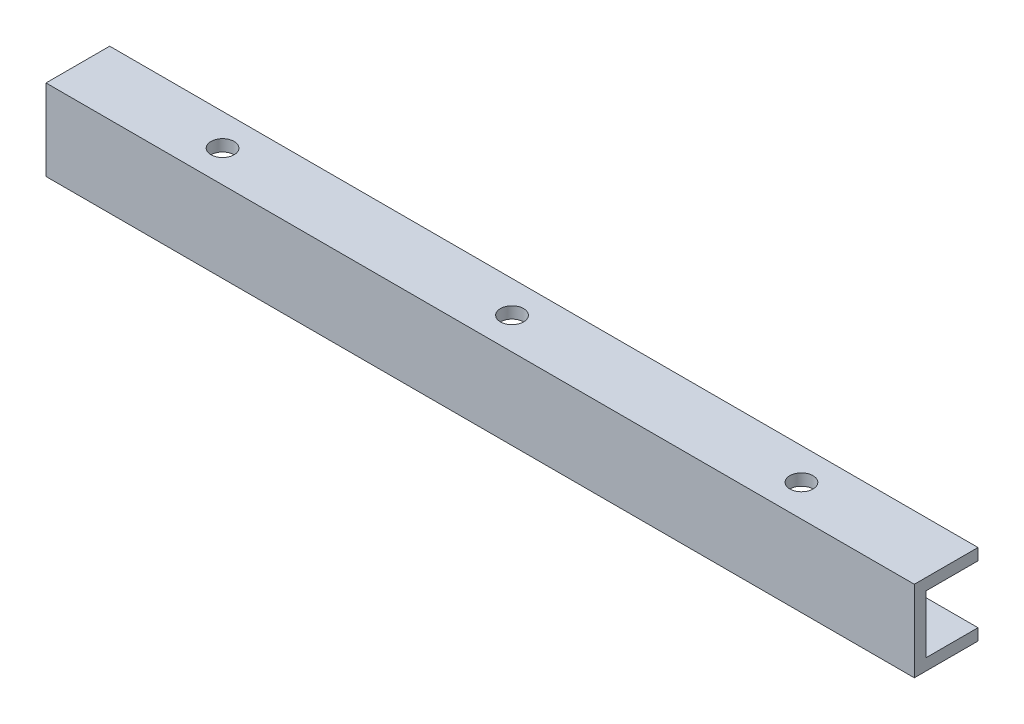
ISO-10303-21;
HEADER;
FILE_DESCRIPTION(('STEP AP214'),'2;1');
FILE_NAME('part.step','',(''),(''),'','','');
FILE_SCHEMA(('AUTOMOTIVE_DESIGN { 1 0 10303 214 1 1 1 1 }'));
ENDSEC;
DATA;
#1=APPLICATION_CONTEXT('core data for automotive mechanical design processes');
#2=APPLICATION_PROTOCOL_DEFINITION('international standard','automotive_design',2000,#1);
#3=PRODUCT_CONTEXT('',#1,'mechanical');
#4=PRODUCT('Part','Part','',(#3));
#5=PRODUCT_RELATED_PRODUCT_CATEGORY('part','',(#4));
#6=PRODUCT_DEFINITION_FORMATION('','',#4);
#7=PRODUCT_DEFINITION_CONTEXT('part definition',#1,'design');
#8=PRODUCT_DEFINITION('design','',#6,#7);
#9=PRODUCT_DEFINITION_SHAPE('','',#8);
#10=(LENGTH_UNIT() NAMED_UNIT(*) SI_UNIT(.MILLI.,.METRE.));
#11=(NAMED_UNIT(*) PLANE_ANGLE_UNIT() SI_UNIT($,.RADIAN.));
#12=(NAMED_UNIT(*) SI_UNIT($,.STERADIAN.) SOLID_ANGLE_UNIT());
#13=UNCERTAINTY_MEASURE_WITH_UNIT(LENGTH_MEASURE(1.E-05),#10,'distance_accuracy_value','');
#14=(GEOMETRIC_REPRESENTATION_CONTEXT(3) GLOBAL_UNCERTAINTY_ASSIGNED_CONTEXT((#13)) GLOBAL_UNIT_ASSIGNED_CONTEXT((#10,
#11,#12)) REPRESENTATION_CONTEXT('',''));
#15=CARTESIAN_POINT('',(0.,0.,0.));
#16=DIRECTION('',(0.,0.,1.));
#17=DIRECTION('',(1.,0.,0.));
#18=AXIS2_PLACEMENT_3D('',#15,#16,#17);
#19=CARTESIAN_POINT('',(0.,-12.,10.));
#20=DIRECTION('',(1.,0.,0.));
#21=DIRECTION('',(0.,0.,-1.));
#22=AXIS2_PLACEMENT_3D('',#19,#20,#21);
#23=PLANE('',#22);
#24=DIRECTION('',(0.,0.,1.));
#25=VECTOR('',#24,1.);
#26=CARTESIAN_POINT('',(0.,-11.,10.));
#27=LINE('',#26,#25);
#28=CARTESIAN_POINT('',(0.,-11.,9.));
#29=VERTEX_POINT('',#28);
#30=CARTESIAN_POINT('',(0.,-11.,0.));
#31=VERTEX_POINT('',#30);
#32=EDGE_CURVE('E162',#29,#31,#27,.F.);
#33=ORIENTED_EDGE('',*,*,#32,.F.);
#34=DIRECTION('',(0.,1.,0.));
#35=VECTOR('',#34,1.);
#36=CARTESIAN_POINT('',(0.,0.,9.));
#37=LINE('',#36,#35);
#38=CARTESIAN_POINT('',(0.,-1.,9.));
#39=VERTEX_POINT('',#38);
#40=EDGE_CURVE('E136',#39,#29,#37,.F.);
#41=ORIENTED_EDGE('',*,*,#40,.F.);
#42=DIRECTION('',(0.,0.,-1.));
#43=VECTOR('',#42,1.);
#44=CARTESIAN_POINT('',(0.,-1.,0.));
#45=LINE('',#44,#43);
#46=CARTESIAN_POINT('',(0.,-1.,0.));
#47=VERTEX_POINT('',#46);
#48=EDGE_CURVE('E94',#47,#39,#45,.F.);
#49=ORIENTED_EDGE('',*,*,#48,.F.);
#50=DIRECTION('',(0.,-1.,0.));
#51=VECTOR('',#50,1.);
#52=CARTESIAN_POINT('',(0.,0.,0.));
#53=LINE('',#52,#51);
#54=CARTESIAN_POINT('',(0.,1.,0.));
#55=VERTEX_POINT('',#54);
#56=EDGE_CURVE('E11',#55,#47,#53,.T.);
#57=ORIENTED_EDGE('',*,*,#56,.F.);
#58=DIRECTION('',(0.,0.,-1.));
#59=VECTOR('',#58,1.);
#60=CARTESIAN_POINT('',(0.,1.,0.));
#61=LINE('',#60,#59);
#62=CARTESIAN_POINT('',(0.,0.999999999999999,11.));
#63=VERTEX_POINT('',#62);
#64=EDGE_CURVE('E92',#55,#63,#61,.F.);
#65=ORIENTED_EDGE('',*,*,#64,.T.);
#66=DIRECTION('',(0.,1.,0.));
#67=VECTOR('',#66,1.);
#68=CARTESIAN_POINT('',(0.,0.,11.));
#69=LINE('',#68,#67);
#70=CARTESIAN_POINT('',(0.,-13.,11.));
#71=VERTEX_POINT('',#70);
#72=EDGE_CURVE('E115',#63,#71,#69,.F.);
#73=ORIENTED_EDGE('',*,*,#72,.T.);
#74=DIRECTION('',(0.,0.,1.));
#75=VECTOR('',#74,1.);
#76=CARTESIAN_POINT('',(0.,-13.,10.));
#77=LINE('',#76,#75);
#78=CARTESIAN_POINT('',(0.,-13.,0.));
#79=VERTEX_POINT('',#78);
#80=EDGE_CURVE('E143',#71,#79,#77,.F.);
#81=ORIENTED_EDGE('',*,*,#80,.T.);
#82=DIRECTION('',(0.,1.,0.));
#83=VECTOR('',#82,1.);
#84=CARTESIAN_POINT('',(0.,-12.,0.));
#85=LINE('',#84,#83);
#86=EDGE_CURVE('E45',#79,#31,#85,.T.);
#87=ORIENTED_EDGE('',*,*,#86,.T.);
#88=EDGE_LOOP('',(#33,#41,#49,#57,#65,#73,#81,#87));
#89=FACE_BOUND('',#88,.T.);
#90=ADVANCED_FACE('F35',(#89),#23,.T.);
#91=CARTESIAN_POINT('',(0.,-12.,0.));
#92=DIRECTION('',(0.,0.,-1.));
#93=DIRECTION('',(-1.,0.,0.));
#94=AXIS2_PLACEMENT_3D('',#91,#92,#93);
#95=PLANE('',#94);
#96=ORIENTED_EDGE('',*,*,#86,.F.);
#97=DIRECTION('',(1.,0.,0.));
#98=VECTOR('',#97,1.);
#99=CARTESIAN_POINT('',(0.,-13.,0.));
#100=LINE('',#99,#98);
#101=CARTESIAN_POINT('',(-150.,-13.,0.));
#102=VERTEX_POINT('',#101);
#103=EDGE_CURVE('E148',#79,#102,#100,.F.);
#104=ORIENTED_EDGE('',*,*,#103,.T.);
#105=DIRECTION('',(0.,1.,0.));
#106=VECTOR('',#105,1.);
#107=CARTESIAN_POINT('',(-150.,-12.,0.));
#108=LINE('',#107,#106);
#109=CARTESIAN_POINT('',(-150.,-11.,0.));
#110=VERTEX_POINT('',#109);
#111=EDGE_CURVE('E118',#102,#110,#108,.T.);
#112=ORIENTED_EDGE('',*,*,#111,.T.);
#113=DIRECTION('',(1.,0.,0.));
#114=VECTOR('',#113,1.);
#115=CARTESIAN_POINT('',(0.,-11.,0.));
#116=LINE('',#115,#114);
#117=EDGE_CURVE('E158',#31,#110,#116,.F.);
#118=ORIENTED_EDGE('',*,*,#117,.F.);
#119=EDGE_LOOP('',(#96,#104,#112,#118));
#120=FACE_BOUND('',#119,.T.);
#121=ADVANCED_FACE('F157',(#120),#95,.T.);
#122=CARTESIAN_POINT('',(-150.,0.,0.));
#123=DIRECTION('',(1.,0.,0.));
#124=DIRECTION('',(0.,0.,1.));
#125=AXIS2_PLACEMENT_3D('',#122,#123,#124);
#126=PLANE('',#125);
#127=DIRECTION('',(0.,0.,-1.));
#128=VECTOR('',#127,1.);
#129=CARTESIAN_POINT('',(-150.,-1.,0.));
#130=LINE('',#129,#128);
#131=CARTESIAN_POINT('',(-150.,-1.,0.));
#132=VERTEX_POINT('',#131);
#133=CARTESIAN_POINT('',(-150.,-1.,9.));
#134=VERTEX_POINT('',#133);
#135=EDGE_CURVE('E133',#132,#134,#130,.F.);
#136=ORIENTED_EDGE('',*,*,#135,.T.);
#137=DIRECTION('',(0.,1.,0.));
#138=VECTOR('',#137,1.);
#139=CARTESIAN_POINT('',(-150.,0.,9.));
#140=LINE('',#139,#138);
#141=CARTESIAN_POINT('',(-150.,-11.,9.));
#142=VERTEX_POINT('',#141);
#143=EDGE_CURVE('E161',#134,#142,#140,.F.);
#144=ORIENTED_EDGE('',*,*,#143,.T.);
#145=DIRECTION('',(0.,0.,1.));
#146=VECTOR('',#145,1.);
#147=CARTESIAN_POINT('',(-150.,-11.,10.));
#148=LINE('',#147,#146);
#149=EDGE_CURVE('E109',#142,#110,#148,.F.);
#150=ORIENTED_EDGE('',*,*,#149,.T.);
#151=ORIENTED_EDGE('',*,*,#111,.F.);
#152=DIRECTION('',(0.,0.,1.));
#153=VECTOR('',#152,1.);
#154=CARTESIAN_POINT('',(-150.,-13.,10.));
#155=LINE('',#154,#153);
#156=CARTESIAN_POINT('',(-150.,-13.,11.));
#157=VERTEX_POINT('',#156);
#158=EDGE_CURVE('E144',#157,#102,#155,.F.);
#159=ORIENTED_EDGE('',*,*,#158,.F.);
#160=DIRECTION('',(0.,1.,0.));
#161=VECTOR('',#160,1.);
#162=CARTESIAN_POINT('',(-150.,0.,11.));
#163=LINE('',#162,#161);
#164=CARTESIAN_POINT('',(-150.,0.999999999999999,11.));
#165=VERTEX_POINT('',#164);
#166=EDGE_CURVE('E140',#165,#157,#163,.F.);
#167=ORIENTED_EDGE('',*,*,#166,.F.);
#168=DIRECTION('',(0.,0.,-1.));
#169=VECTOR('',#168,1.);
#170=CARTESIAN_POINT('',(-150.,1.,0.));
#171=LINE('',#170,#169);
#172=CARTESIAN_POINT('',(-150.,1.,0.));
#173=VERTEX_POINT('',#172);
#174=EDGE_CURVE('E104',#173,#165,#171,.F.);
#175=ORIENTED_EDGE('',*,*,#174,.F.);
#176=DIRECTION('',(0.,-1.,0.));
#177=VECTOR('',#176,1.);
#178=CARTESIAN_POINT('',(-150.,0.,0.));
#179=LINE('',#178,#177);
#180=EDGE_CURVE('E39',#173,#132,#179,.T.);
#181=ORIENTED_EDGE('',*,*,#180,.T.);
#182=EDGE_LOOP('',(#136,#144,#150,#151,#159,#167,#175,#181));
#183=FACE_BOUND('',#182,.T.);
#184=ADVANCED_FACE('F238',(#183),#126,.F.);
#185=CARTESIAN_POINT('',(0.,0.,0.));
#186=DIRECTION('',(0.,0.,1.));
#187=DIRECTION('',(-1.,0.,0.));
#188=AXIS2_PLACEMENT_3D('',#185,#186,#187);
#189=PLANE('',#188);
#190=DIRECTION('',(1.,0.,0.));
#191=VECTOR('',#190,1.);
#192=CARTESIAN_POINT('',(0.,1.,0.));
#193=LINE('',#192,#191);
#194=EDGE_CURVE('E100',#55,#173,#193,.F.);
#195=ORIENTED_EDGE('',*,*,#194,.F.);
#196=ORIENTED_EDGE('',*,*,#56,.T.);
#197=DIRECTION('',(1.,0.,0.));
#198=VECTOR('',#197,1.);
#199=CARTESIAN_POINT('',(0.,-1.,0.));
#200=LINE('',#199,#198);
#201=EDGE_CURVE('E128',#47,#132,#200,.F.);
#202=ORIENTED_EDGE('',*,*,#201,.T.);
#203=ORIENTED_EDGE('',*,*,#180,.F.);
#204=EDGE_LOOP('',(#195,#196,#202,#203));
#205=FACE_BOUND('',#204,.T.);
#206=ADVANCED_FACE('F37',(#205),#189,.F.);
#207=CARTESIAN_POINT('',(0.,-1.,0.));
#208=DIRECTION('',(0.,-1.,0.));
#209=DIRECTION('',(0.,0.,-1.));
#210=AXIS2_PLACEMENT_3D('',#207,#208,#209);
#211=PLANE('',#210);
#212=CARTESIAN_POINT('',(-125.,-1.,5.5));
#213=DIRECTION('',(0.,-1.,0.));
#214=DIRECTION('',(0.,0.,-1.));
#215=AXIS2_PLACEMENT_3D('',#212,#213,#214);
#216=CIRCLE('',#215,2.);
#217=CARTESIAN_POINT('',(-125.,-1.,3.5));
#218=VERTEX_POINT('',#217);
#219=EDGE_CURVE('E198',#218,#218,#216,.T.);
#220=ORIENTED_EDGE('',*,*,#219,.F.);
#221=EDGE_LOOP('',(#220));
#222=FACE_BOUND('',#221,.T.);
#223=CARTESIAN_POINT('',(-75.,-1.,5.5));
#224=DIRECTION('',(0.,-1.,0.));
#225=DIRECTION('',(0.,0.,-1.));
#226=AXIS2_PLACEMENT_3D('',#223,#224,#225);
#227=CIRCLE('',#226,2.);
#228=CARTESIAN_POINT('',(-75.,-1.,3.5));
#229=VERTEX_POINT('',#228);
#230=EDGE_CURVE('E183',#229,#229,#227,.T.);
#231=ORIENTED_EDGE('',*,*,#230,.F.);
#232=EDGE_LOOP('',(#231));
#233=FACE_BOUND('',#232,.T.);
#234=CARTESIAN_POINT('',(-25.,-1.,5.5));
#235=DIRECTION('',(0.,-1.,0.));
#236=DIRECTION('',(0.,0.,-1.));
#237=AXIS2_PLACEMENT_3D('',#234,#235,#236);
#238=CIRCLE('',#237,2.);
#239=CARTESIAN_POINT('',(-25.,-1.,3.5));
#240=VERTEX_POINT('',#239);
#241=EDGE_CURVE('E151',#240,#240,#238,.T.);
#242=ORIENTED_EDGE('',*,*,#241,.F.);
#243=EDGE_LOOP('',(#242));
#244=FACE_BOUND('',#243,.T.);
#245=ORIENTED_EDGE('',*,*,#135,.F.);
#246=ORIENTED_EDGE('',*,*,#201,.F.);
#247=ORIENTED_EDGE('',*,*,#48,.T.);
#248=DIRECTION('',(-1.,0.,0.));
#249=VECTOR('',#248,1.);
#250=CARTESIAN_POINT('',(0.,-1.,9.));
#251=LINE('',#250,#249);
#252=EDGE_CURVE('E165',#39,#134,#251,.T.);
#253=ORIENTED_EDGE('',*,*,#252,.T.);
#254=EDGE_LOOP('',(#245,#246,#247,#253));
#255=FACE_BOUND('',#254,.T.);
#256=ADVANCED_FACE('F254',(#222,#233,#244,#255),#211,.T.);
#257=CARTESIAN_POINT('',(0.,0.,9.));
#258=DIRECTION('',(0.,0.,-1.));
#259=DIRECTION('',(0.,1.,0.));
#260=AXIS2_PLACEMENT_3D('',#257,#258,#259);
#261=PLANE('',#260);
#262=ORIENTED_EDGE('',*,*,#143,.F.);
#263=ORIENTED_EDGE('',*,*,#252,.F.);
#264=ORIENTED_EDGE('',*,*,#40,.T.);
#265=DIRECTION('',(-1.,0.,0.));
#266=VECTOR('',#265,1.);
#267=CARTESIAN_POINT('',(0.,-11.,9.));
#268=LINE('',#267,#266);
#269=EDGE_CURVE('E112',#29,#142,#268,.T.);
#270=ORIENTED_EDGE('',*,*,#269,.T.);
#271=EDGE_LOOP('',(#262,#263,#264,#270));
#272=FACE_BOUND('',#271,.T.);
#273=ADVANCED_FACE('F251',(#272),#261,.T.);
#274=CARTESIAN_POINT('',(0.,-11.,10.));
#275=DIRECTION('',(0.,1.,0.));
#276=DIRECTION('',(0.,0.,1.));
#277=AXIS2_PLACEMENT_3D('',#274,#275,#276);
#278=PLANE('',#277);
#279=CARTESIAN_POINT('',(-125.,-11.,5.5));
#280=DIRECTION('',(0.,1.,0.));
#281=DIRECTION('',(0.,0.,1.));
#282=AXIS2_PLACEMENT_3D('',#279,#280,#281);
#283=CIRCLE('',#282,2.);
#284=CARTESIAN_POINT('',(-125.,-11.,7.5));
#285=VERTEX_POINT('',#284);
#286=EDGE_CURVE('E195',#285,#285,#283,.T.);
#287=ORIENTED_EDGE('',*,*,#286,.F.);
#288=EDGE_LOOP('',(#287));
#289=FACE_BOUND('',#288,.T.);
#290=CARTESIAN_POINT('',(-75.,-11.,5.5));
#291=DIRECTION('',(0.,1.,0.));
#292=DIRECTION('',(0.,0.,1.));
#293=AXIS2_PLACEMENT_3D('',#290,#291,#292);
#294=CIRCLE('',#293,2.);
#295=CARTESIAN_POINT('',(-75.,-11.,7.5));
#296=VERTEX_POINT('',#295);
#297=EDGE_CURVE('E186',#296,#296,#294,.T.);
#298=ORIENTED_EDGE('',*,*,#297,.F.);
#299=EDGE_LOOP('',(#298));
#300=FACE_BOUND('',#299,.T.);
#301=CARTESIAN_POINT('',(-25.,-11.,5.5));
#302=DIRECTION('',(0.,1.,0.));
#303=DIRECTION('',(0.,0.,1.));
#304=AXIS2_PLACEMENT_3D('',#301,#302,#303);
#305=CIRCLE('',#304,2.);
#306=CARTESIAN_POINT('',(-25.,-11.,7.5));
#307=VERTEX_POINT('',#306);
#308=EDGE_CURVE('E174',#307,#307,#305,.T.);
#309=ORIENTED_EDGE('',*,*,#308,.F.);
#310=EDGE_LOOP('',(#309));
#311=FACE_BOUND('',#310,.T.);
#312=ORIENTED_EDGE('',*,*,#149,.F.);
#313=ORIENTED_EDGE('',*,*,#269,.F.);
#314=ORIENTED_EDGE('',*,*,#32,.T.);
#315=ORIENTED_EDGE('',*,*,#117,.T.);
#316=EDGE_LOOP('',(#312,#313,#314,#315));
#317=FACE_BOUND('',#316,.T.);
#318=ADVANCED_FACE('F213',(#289,#300,#311,#317),#278,.T.);
#319=CARTESIAN_POINT('',(0.,1.,0.));
#320=DIRECTION('',(0.,-1.,0.));
#321=DIRECTION('',(0.,0.,-1.));
#322=AXIS2_PLACEMENT_3D('',#319,#320,#321);
#323=PLANE('',#322);
#324=CARTESIAN_POINT('',(-125.,0.999999999999999,5.5));
#325=DIRECTION('',(0.,1.,0.));
#326=DIRECTION('',(0.,0.,1.));
#327=AXIS2_PLACEMENT_3D('',#324,#325,#326);
#328=CIRCLE('',#327,2.);
#329=CARTESIAN_POINT('',(-125.,0.999999999999999,7.5));
#330=VERTEX_POINT('',#329);
#331=EDGE_CURVE('E204',#330,#330,#328,.T.);
#332=ORIENTED_EDGE('',*,*,#331,.F.);
#333=EDGE_LOOP('',(#332));
#334=FACE_BOUND('',#333,.T.);
#335=CARTESIAN_POINT('',(-75.,0.999999999999999,5.5));
#336=DIRECTION('',(0.,1.,0.));
#337=DIRECTION('',(0.,0.,1.));
#338=AXIS2_PLACEMENT_3D('',#335,#336,#337);
#339=CIRCLE('',#338,2.);
#340=CARTESIAN_POINT('',(-75.,0.999999999999999,7.5));
#341=VERTEX_POINT('',#340);
#342=EDGE_CURVE('E192',#341,#341,#339,.T.);
#343=ORIENTED_EDGE('',*,*,#342,.F.);
#344=EDGE_LOOP('',(#343));
#345=FACE_BOUND('',#344,.T.);
#346=CARTESIAN_POINT('',(-25.,0.999999999999999,5.5));
#347=DIRECTION('',(0.,1.,0.));
#348=DIRECTION('',(0.,0.,1.));
#349=AXIS2_PLACEMENT_3D('',#346,#347,#348);
#350=CIRCLE('',#349,2.);
#351=CARTESIAN_POINT('',(-25.,0.999999999999999,7.5));
#352=VERTEX_POINT('',#351);
#353=EDGE_CURVE('E180',#352,#352,#350,.T.);
#354=ORIENTED_EDGE('',*,*,#353,.F.);
#355=EDGE_LOOP('',(#354));
#356=FACE_BOUND('',#355,.T.);
#357=ORIENTED_EDGE('',*,*,#174,.T.);
#358=DIRECTION('',(-1.,0.,0.));
#359=VECTOR('',#358,1.);
#360=CARTESIAN_POINT('',(0.,0.999999999999999,11.));
#361=LINE('',#360,#359);
#362=EDGE_CURVE('E107',#63,#165,#361,.T.);
#363=ORIENTED_EDGE('',*,*,#362,.F.);
#364=ORIENTED_EDGE('',*,*,#64,.F.);
#365=ORIENTED_EDGE('',*,*,#194,.T.);
#366=EDGE_LOOP('',(#357,#363,#364,#365));
#367=FACE_BOUND('',#366,.T.);
#368=ADVANCED_FACE('F106',(#334,#345,#356,#367),#323,.F.);
#369=CARTESIAN_POINT('',(0.,0.,11.));
#370=DIRECTION('',(0.,0.,-1.));
#371=DIRECTION('',(0.,1.,0.));
#372=AXIS2_PLACEMENT_3D('',#369,#370,#371);
#373=PLANE('',#372);
#374=ORIENTED_EDGE('',*,*,#166,.T.);
#375=DIRECTION('',(-1.,0.,0.));
#376=VECTOR('',#375,1.);
#377=CARTESIAN_POINT('',(0.,-13.,11.));
#378=LINE('',#377,#376);
#379=EDGE_CURVE('E141',#71,#157,#378,.T.);
#380=ORIENTED_EDGE('',*,*,#379,.F.);
#381=ORIENTED_EDGE('',*,*,#72,.F.);
#382=ORIENTED_EDGE('',*,*,#362,.T.);
#383=EDGE_LOOP('',(#374,#380,#381,#382));
#384=FACE_BOUND('',#383,.T.);
#385=ADVANCED_FACE('F212',(#384),#373,.F.);
#386=CARTESIAN_POINT('',(0.,-13.,10.));
#387=DIRECTION('',(0.,1.,0.));
#388=DIRECTION('',(0.,0.,1.));
#389=AXIS2_PLACEMENT_3D('',#386,#387,#388);
#390=PLANE('',#389);
#391=CARTESIAN_POINT('',(-125.,-13.,5.5));
#392=DIRECTION('',(0.,1.,0.));
#393=DIRECTION('',(0.,0.,1.));
#394=AXIS2_PLACEMENT_3D('',#391,#392,#393);
#395=CIRCLE('',#394,2.);
#396=CARTESIAN_POINT('',(-125.,-13.,7.5));
#397=VERTEX_POINT('',#396);
#398=EDGE_CURVE('E201',#397,#397,#395,.T.);
#399=ORIENTED_EDGE('',*,*,#398,.T.);
#400=EDGE_LOOP('',(#399));
#401=FACE_BOUND('',#400,.T.);
#402=CARTESIAN_POINT('',(-75.,-13.,5.5));
#403=DIRECTION('',(0.,1.,0.));
#404=DIRECTION('',(0.,0.,1.));
#405=AXIS2_PLACEMENT_3D('',#402,#403,#404);
#406=CIRCLE('',#405,2.);
#407=CARTESIAN_POINT('',(-75.,-13.,7.5));
#408=VERTEX_POINT('',#407);
#409=EDGE_CURVE('E189',#408,#408,#406,.T.);
#410=ORIENTED_EDGE('',*,*,#409,.T.);
#411=EDGE_LOOP('',(#410));
#412=FACE_BOUND('',#411,.T.);
#413=CARTESIAN_POINT('',(-25.,-13.,5.5));
#414=DIRECTION('',(0.,1.,0.));
#415=DIRECTION('',(0.,0.,1.));
#416=AXIS2_PLACEMENT_3D('',#413,#414,#415);
#417=CIRCLE('',#416,2.);
#418=CARTESIAN_POINT('',(-25.,-13.,7.5));
#419=VERTEX_POINT('',#418);
#420=EDGE_CURVE('E177',#419,#419,#417,.T.);
#421=ORIENTED_EDGE('',*,*,#420,.T.);
#422=EDGE_LOOP('',(#421));
#423=FACE_BOUND('',#422,.T.);
#424=ORIENTED_EDGE('',*,*,#158,.T.);
#425=ORIENTED_EDGE('',*,*,#103,.F.);
#426=ORIENTED_EDGE('',*,*,#80,.F.);
#427=ORIENTED_EDGE('',*,*,#379,.T.);
#428=EDGE_LOOP('',(#424,#425,#426,#427));
#429=FACE_BOUND('',#428,.T.);
#430=ADVANCED_FACE('F155',(#401,#412,#423,#429),#390,.F.);
#431=CARTESIAN_POINT('',(-25.,0.999999999999999,5.5));
#432=DIRECTION('',(0.,1.,0.));
#433=DIRECTION('',(0.,0.,1.));
#434=AXIS2_PLACEMENT_3D('',#431,#432,#433);
#435=CYLINDRICAL_SURFACE('',#434,2.);
#436=ORIENTED_EDGE('',*,*,#308,.T.);
#437=EDGE_LOOP('',(#436));
#438=FACE_BOUND('',#437,.T.);
#439=ORIENTED_EDGE('',*,*,#420,.F.);
#440=EDGE_LOOP('',(#439));
#441=FACE_BOUND('',#440,.T.);
#442=ADVANCED_FACE('F222',(#438,#441),#435,.F.);
#443=ORIENTED_EDGE('',*,*,#241,.T.);
#444=EDGE_LOOP('',(#443));
#445=FACE_BOUND('',#444,.T.);
#446=ORIENTED_EDGE('',*,*,#353,.T.);
#447=EDGE_LOOP('',(#446));
#448=FACE_BOUND('',#447,.T.);
#449=ADVANCED_FACE('F219',(#445,#448),#435,.F.);
#450=CARTESIAN_POINT('',(-75.,0.999999999999999,5.5));
#451=DIRECTION('',(0.,1.,0.));
#452=DIRECTION('',(0.,0.,1.));
#453=AXIS2_PLACEMENT_3D('',#450,#451,#452);
#454=CYLINDRICAL_SURFACE('',#453,2.);
#455=ORIENTED_EDGE('',*,*,#297,.T.);
#456=EDGE_LOOP('',(#455));
#457=FACE_BOUND('',#456,.T.);
#458=ORIENTED_EDGE('',*,*,#409,.F.);
#459=EDGE_LOOP('',(#458));
#460=FACE_BOUND('',#459,.T.);
#461=ADVANCED_FACE('F221',(#457,#460),#454,.F.);
#462=ORIENTED_EDGE('',*,*,#230,.T.);
#463=EDGE_LOOP('',(#462));
#464=FACE_BOUND('',#463,.T.);
#465=ORIENTED_EDGE('',*,*,#342,.T.);
#466=EDGE_LOOP('',(#465));
#467=FACE_BOUND('',#466,.T.);
#468=ADVANCED_FACE('F229',(#464,#467),#454,.F.);
#469=CARTESIAN_POINT('',(-125.,0.999999999999999,5.5));
#470=DIRECTION('',(0.,1.,0.));
#471=DIRECTION('',(0.,0.,1.));
#472=AXIS2_PLACEMENT_3D('',#469,#470,#471);
#473=CYLINDRICAL_SURFACE('',#472,2.);
#474=ORIENTED_EDGE('',*,*,#286,.T.);
#475=EDGE_LOOP('',(#474));
#476=FACE_BOUND('',#475,.T.);
#477=ORIENTED_EDGE('',*,*,#398,.F.);
#478=EDGE_LOOP('',(#477));
#479=FACE_BOUND('',#478,.T.);
#480=ADVANCED_FACE('F274',(#476,#479),#473,.F.);
#481=ORIENTED_EDGE('',*,*,#219,.T.);
#482=EDGE_LOOP('',(#481));
#483=FACE_BOUND('',#482,.T.);
#484=ORIENTED_EDGE('',*,*,#331,.T.);
#485=EDGE_LOOP('',(#484));
#486=FACE_BOUND('',#485,.T.);
#487=ADVANCED_FACE('F208',(#483,#486),#473,.F.);
#488=CLOSED_SHELL('',(#90,#121,#184,#206,#256,#273,#318,#368,#385,#430,#442,#449,#461,#468,#480,#487));
#489=MANIFOLD_SOLID_BREP('B2',#488);
#490=ADVANCED_BREP_SHAPE_REPRESENTATION('',(#18,#489),#14);
#491=SHAPE_DEFINITION_REPRESENTATION(#9,#490);
ENDSEC;
END-ISO-10303-21;
